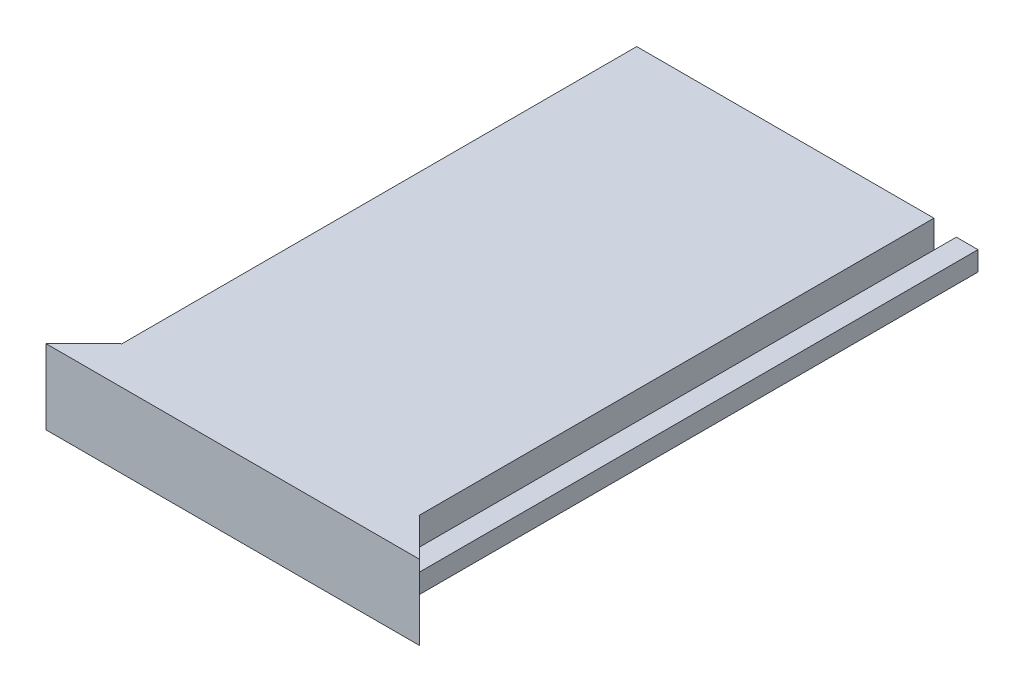
ISO-10303-21;
HEADER;
FILE_DESCRIPTION(('STEP AP214'),'2;1');
FILE_NAME('part.step','',(''),(''),'','','');
FILE_SCHEMA(('AUTOMOTIVE_DESIGN { 1 0 10303 214 1 1 1 1 }'));
ENDSEC;
DATA;
#1=APPLICATION_CONTEXT('core data for automotive mechanical design processes');
#2=APPLICATION_PROTOCOL_DEFINITION('international standard','automotive_design',2000,#1);
#3=PRODUCT_CONTEXT('',#1,'mechanical');
#4=PRODUCT('Part','Part','',(#3));
#5=PRODUCT_RELATED_PRODUCT_CATEGORY('part','',(#4));
#6=PRODUCT_DEFINITION_FORMATION('','',#4);
#7=PRODUCT_DEFINITION_CONTEXT('part definition',#1,'design');
#8=PRODUCT_DEFINITION('design','',#6,#7);
#9=PRODUCT_DEFINITION_SHAPE('','',#8);
#10=(LENGTH_UNIT() NAMED_UNIT(*) SI_UNIT(.MILLI.,.METRE.));
#11=(NAMED_UNIT(*) PLANE_ANGLE_UNIT() SI_UNIT($,.RADIAN.));
#12=(NAMED_UNIT(*) SI_UNIT($,.STERADIAN.) SOLID_ANGLE_UNIT());
#13=UNCERTAINTY_MEASURE_WITH_UNIT(LENGTH_MEASURE(1.E-05),#10,'distance_accuracy_value','');
#14=(GEOMETRIC_REPRESENTATION_CONTEXT(3) GLOBAL_UNCERTAINTY_ASSIGNED_CONTEXT((#13)) GLOBAL_UNIT_ASSIGNED_CONTEXT((#10,
#11,#12)) REPRESENTATION_CONTEXT('',''));
#15=CARTESIAN_POINT('',(0.,0.,0.));
#16=DIRECTION('',(0.,0.,1.));
#17=DIRECTION('',(1.,0.,0.));
#18=AXIS2_PLACEMENT_3D('',#15,#16,#17);
#19=CARTESIAN_POINT('',(0.,0.,-72.));
#20=DIRECTION('',(0.,0.,1.));
#21=DIRECTION('',(1.,0.,0.));
#22=AXIS2_PLACEMENT_3D('',#19,#20,#21);
#23=PLANE('',#22);
#24=DIRECTION('',(-1.,0.,0.));
#25=VECTOR('',#24,1.);
#26=CARTESIAN_POINT('',(-22.8,1.3,-72.));
#27=LINE('',#26,#25);
#28=CARTESIAN_POINT('',(-19.9,1.3,-72.));
#29=VERTEX_POINT('',#28);
#30=CARTESIAN_POINT('',(-22.8,1.3,-72.));
#31=VERTEX_POINT('',#30);
#32=EDGE_CURVE('E229',#29,#31,#27,.T.);
#33=ORIENTED_EDGE('',*,*,#32,.F.);
#34=DIRECTION('',(0.,1.,0.));
#35=VECTOR('',#34,1.);
#36=CARTESIAN_POINT('',(-19.9,-5.,-72.));
#37=LINE('',#36,#35);
#38=CARTESIAN_POINT('',(-19.9,-1.3,-72.));
#39=VERTEX_POINT('',#38);
#40=EDGE_CURVE('E357',#39,#29,#37,.T.);
#41=ORIENTED_EDGE('',*,*,#40,.F.);
#42=DIRECTION('',(1.,0.,0.));
#43=VECTOR('',#42,1.);
#44=CARTESIAN_POINT('',(-22.8,-1.3,-72.));
#45=LINE('',#44,#43);
#46=CARTESIAN_POINT('',(-22.8,-1.3,-72.));
#47=VERTEX_POINT('',#46);
#48=EDGE_CURVE('E223',#47,#39,#45,.T.);
#49=ORIENTED_EDGE('',*,*,#48,.F.);
#50=DIRECTION('',(0.,-1.,0.));
#51=VECTOR('',#50,1.);
#52=CARTESIAN_POINT('',(-22.8,1.3,-72.));
#53=LINE('',#52,#51);
#54=EDGE_CURVE('E219',#31,#47,#53,.T.);
#55=ORIENTED_EDGE('',*,*,#54,.F.);
#56=EDGE_LOOP('',(#33,#41,#49,#55));
#57=FACE_BOUND('',#56,.T.);
#58=ADVANCED_FACE('F35',(#57),#23,.F.);
#59=CARTESIAN_POINT('',(0.,0.,0.));
#60=DIRECTION('',(0.,0.,1.));
#61=DIRECTION('',(1.,0.,0.));
#62=AXIS2_PLACEMENT_3D('',#59,#60,#61);
#63=PLANE('',#62);
#64=DIRECTION('',(0.,-1.,0.));
#65=VECTOR('',#64,1.);
#66=CARTESIAN_POINT('',(19.9,-1.3,0.));
#67=LINE('',#66,#65);
#68=CARTESIAN_POINT('',(19.9,5.,0.));
#69=VERTEX_POINT('',#68);
#70=CARTESIAN_POINT('',(19.9,1.3,0.));
#71=VERTEX_POINT('',#70);
#72=EDGE_CURVE('E203',#69,#71,#67,.T.);
#73=ORIENTED_EDGE('',*,*,#72,.F.);
#74=DIRECTION('',(-1.,0.,0.));
#75=VECTOR('',#74,1.);
#76=CARTESIAN_POINT('',(-25.,5.,0.));
#77=LINE('',#76,#75);
#78=CARTESIAN_POINT('',(20.,5.,0.));
#79=VERTEX_POINT('',#78);
#80=EDGE_CURVE('E291',#79,#69,#77,.T.);
#81=ORIENTED_EDGE('',*,*,#80,.F.);
#82=DIRECTION('',(0.,1.,0.));
#83=VECTOR('',#82,1.);
#84=CARTESIAN_POINT('',(20.,-5.,0.));
#85=LINE('',#84,#83);
#86=CARTESIAN_POINT('',(20.,1.3,0.));
#87=VERTEX_POINT('',#86);
#88=EDGE_CURVE('E274',#87,#79,#85,.T.);
#89=ORIENTED_EDGE('',*,*,#88,.F.);
#90=DIRECTION('',(-1.,0.,0.));
#91=VECTOR('',#90,1.);
#92=CARTESIAN_POINT('',(0.,1.3,0.));
#93=LINE('',#92,#91);
#94=EDGE_CURVE('E251',#87,#71,#93,.T.);
#95=ORIENTED_EDGE('',*,*,#94,.T.);
#96=EDGE_LOOP('',(#73,#81,#89,#95));
#97=FACE_BOUND('',#96,.T.);
#98=ADVANCED_FACE('F326',(#97),#63,.F.);
#99=DIRECTION('',(0.,1.,0.));
#100=VECTOR('',#99,1.);
#101=CARTESIAN_POINT('',(-19.9,-1.3,0.));
#102=LINE('',#101,#100);
#103=CARTESIAN_POINT('',(-19.9,1.3,0.));
#104=VERTEX_POINT('',#103);
#105=CARTESIAN_POINT('',(-19.9,5.,0.));
#106=VERTEX_POINT('',#105);
#107=EDGE_CURVE('E197',#104,#106,#102,.T.);
#108=ORIENTED_EDGE('',*,*,#107,.F.);
#109=CARTESIAN_POINT('',(-20.,1.3,0.));
#110=VERTEX_POINT('',#109);
#111=EDGE_CURVE('E250',#104,#110,#93,.T.);
#112=ORIENTED_EDGE('',*,*,#111,.T.);
#113=DIRECTION('',(0.,1.,0.));
#114=VECTOR('',#113,1.);
#115=CARTESIAN_POINT('',(-20.,-5.,0.));
#116=LINE('',#115,#114);
#117=CARTESIAN_POINT('',(-20.,5.,0.));
#118=VERTEX_POINT('',#117);
#119=EDGE_CURVE('E265',#110,#118,#116,.T.);
#120=ORIENTED_EDGE('',*,*,#119,.T.);
#121=EDGE_CURVE('E269',#106,#118,#77,.T.);
#122=ORIENTED_EDGE('',*,*,#121,.F.);
#123=EDGE_LOOP('',(#108,#112,#120,#122));
#124=FACE_BOUND('',#123,.T.);
#125=ADVANCED_FACE('F401',(#124),#63,.F.);
#126=DIRECTION('',(1.,0.,0.));
#127=VECTOR('',#126,1.);
#128=CARTESIAN_POINT('',(0.,-1.3,0.));
#129=LINE('',#128,#127);
#130=CARTESIAN_POINT('',(-20.,-1.3,0.));
#131=VERTEX_POINT('',#130);
#132=CARTESIAN_POINT('',(-18.4,-1.3,0.));
#133=VERTEX_POINT('',#132);
#134=EDGE_CURVE('E57',#131,#133,#129,.T.);
#135=ORIENTED_EDGE('',*,*,#134,.T.);
#136=DIRECTION('',(0.,-1.,0.));
#137=VECTOR('',#136,1.);
#138=CARTESIAN_POINT('',(-18.4,-1.3,0.));
#139=LINE('',#138,#137);
#140=CARTESIAN_POINT('',(-18.4,3.,0.));
#141=VERTEX_POINT('',#140);
#142=EDGE_CURVE('E372',#141,#133,#139,.T.);
#143=ORIENTED_EDGE('',*,*,#142,.F.);
#144=DIRECTION('',(-1.,0.,0.));
#145=VECTOR('',#144,1.);
#146=CARTESIAN_POINT('',(18.4,3.,0.));
#147=LINE('',#146,#145);
#148=CARTESIAN_POINT('',(18.4,3.,0.));
#149=VERTEX_POINT('',#148);
#150=EDGE_CURVE('E370',#149,#141,#147,.T.);
#151=ORIENTED_EDGE('',*,*,#150,.F.);
#152=DIRECTION('',(0.,1.,0.));
#153=VECTOR('',#152,1.);
#154=CARTESIAN_POINT('',(18.4,-1.3,0.));
#155=LINE('',#154,#153);
#156=CARTESIAN_POINT('',(18.4,-1.3,0.));
#157=VERTEX_POINT('',#156);
#158=EDGE_CURVE('E344',#157,#149,#155,.T.);
#159=ORIENTED_EDGE('',*,*,#158,.F.);
#160=CARTESIAN_POINT('',(20.,-1.3,0.));
#161=VERTEX_POINT('',#160);
#162=EDGE_CURVE('E237',#157,#161,#129,.T.);
#163=ORIENTED_EDGE('',*,*,#162,.T.);
#164=CARTESIAN_POINT('',(20.,-5.,0.));
#165=VERTEX_POINT('',#164);
#166=EDGE_CURVE('E262',#165,#161,#85,.T.);
#167=ORIENTED_EDGE('',*,*,#166,.F.);
#168=DIRECTION('',(1.,0.,0.));
#169=VECTOR('',#168,1.);
#170=CARTESIAN_POINT('',(-25.,-5.,0.));
#171=LINE('',#170,#169);
#172=CARTESIAN_POINT('',(-20.,-5.,0.));
#173=VERTEX_POINT('',#172);
#174=EDGE_CURVE('E281',#173,#165,#171,.T.);
#175=ORIENTED_EDGE('',*,*,#174,.F.);
#176=EDGE_CURVE('E266',#173,#131,#116,.T.);
#177=ORIENTED_EDGE('',*,*,#176,.T.);
#178=EDGE_LOOP('',(#135,#143,#151,#159,#163,#167,#175,#177));
#179=FACE_BOUND('',#178,.T.);
#180=ADVANCED_FACE('F340',(#179),#63,.F.);
#181=CARTESIAN_POINT('',(-22.8,1.3,-72.));
#182=DIRECTION('',(0.,1.,0.));
#183=DIRECTION('',(0.,0.,1.));
#184=AXIS2_PLACEMENT_3D('',#181,#182,#183);
#185=PLANE('',#184);
#186=DIRECTION('',(0.,0.,1.));
#187=VECTOR('',#186,1.);
#188=CARTESIAN_POINT('',(-19.9,1.3,0.));
#189=LINE('',#188,#187);
#190=CARTESIAN_POINT('',(-19.9,1.3,-69.));
#191=VERTEX_POINT('',#190);
#192=EDGE_CURVE('E213',#29,#191,#189,.T.);
#193=ORIENTED_EDGE('',*,*,#192,.F.);
#194=ORIENTED_EDGE('',*,*,#32,.T.);
#195=DIRECTION('',(0.,0.,1.));
#196=VECTOR('',#195,1.);
#197=CARTESIAN_POINT('',(-22.8,1.3,-72.));
#198=LINE('',#197,#196);
#199=CARTESIAN_POINT('',(-22.8,1.3,2.80000000000001));
#200=VERTEX_POINT('',#199);
#201=EDGE_CURVE('E234',#31,#200,#198,.T.);
#202=ORIENTED_EDGE('',*,*,#201,.T.);
#203=DIRECTION('',(-0.707106781186551,0.,0.707106781186544));
#204=VECTOR('',#203,1.);
#205=CARTESIAN_POINT('',(-25.,1.3,5.));
#206=LINE('',#205,#204);
#207=EDGE_CURVE('E298',#110,#200,#206,.T.);
#208=ORIENTED_EDGE('',*,*,#207,.F.);
#209=ORIENTED_EDGE('',*,*,#111,.F.);
#210=EDGE_CURVE('E212',#191,#104,#189,.T.);
#211=ORIENTED_EDGE('',*,*,#210,.F.);
#212=EDGE_LOOP('',(#193,#194,#202,#208,#209,#211));
#213=FACE_BOUND('',#212,.T.);
#214=ADVANCED_FACE('F418',(#213),#185,.T.);
#215=CARTESIAN_POINT('',(-22.8,-1.3,-72.));
#216=DIRECTION('',(0.,-1.,0.));
#217=DIRECTION('',(0.,0.,-1.));
#218=AXIS2_PLACEMENT_3D('',#215,#216,#217);
#219=PLANE('',#218);
#220=DIRECTION('',(0.,0.,-1.));
#221=VECTOR('',#220,1.);
#222=CARTESIAN_POINT('',(-19.9,-1.3,-72.));
#223=LINE('',#222,#221);
#224=CARTESIAN_POINT('',(-19.9,-1.3,-69.));
#225=VERTEX_POINT('',#224);
#226=EDGE_CURVE('E367',#225,#39,#223,.T.);
#227=ORIENTED_EDGE('',*,*,#226,.F.);
#228=DIRECTION('',(-1.,0.,0.));
#229=VECTOR('',#228,1.);
#230=CARTESIAN_POINT('',(-22.8,-1.3,-69.));
#231=LINE('',#230,#229);
#232=CARTESIAN_POINT('',(-18.4,-1.3,-69.));
#233=VERTEX_POINT('',#232);
#234=EDGE_CURVE('E364',#233,#225,#231,.T.);
#235=ORIENTED_EDGE('',*,*,#234,.F.);
#236=DIRECTION('',(0.,0.,1.));
#237=VECTOR('',#236,1.);
#238=CARTESIAN_POINT('',(-18.4,-1.3,-112.295533251218));
#239=LINE('',#238,#237);
#240=EDGE_CURVE('E199',#233,#133,#239,.T.);
#241=ORIENTED_EDGE('',*,*,#240,.T.);
#242=ORIENTED_EDGE('',*,*,#134,.F.);
#243=DIRECTION('',(0.707106781186551,0.,-0.707106781186544));
#244=VECTOR('',#243,1.);
#245=CARTESIAN_POINT('',(-25.,-1.3,5.));
#246=LINE('',#245,#244);
#247=CARTESIAN_POINT('',(-22.8,-1.3,2.80000000000001));
#248=VERTEX_POINT('',#247);
#249=EDGE_CURVE('E290',#248,#131,#246,.T.);
#250=ORIENTED_EDGE('',*,*,#249,.F.);
#251=DIRECTION('',(0.,0.,1.));
#252=VECTOR('',#251,1.);
#253=CARTESIAN_POINT('',(-22.8,-1.3,-72.));
#254=LINE('',#253,#252);
#255=EDGE_CURVE('E233',#47,#248,#254,.T.);
#256=ORIENTED_EDGE('',*,*,#255,.F.);
#257=ORIENTED_EDGE('',*,*,#48,.T.);
#258=EDGE_LOOP('',(#227,#235,#241,#242,#250,#256,#257));
#259=FACE_BOUND('',#258,.T.);
#260=ADVANCED_FACE('F413',(#259),#219,.T.);
#261=CARTESIAN_POINT('',(-25.,5.,5.));
#262=DIRECTION('',(0.,-1.,0.));
#263=DIRECTION('',(0.,0.,-1.));
#264=AXIS2_PLACEMENT_3D('',#261,#262,#263);
#265=PLANE('',#264);
#266=DIRECTION('',(0.,0.,1.));
#267=VECTOR('',#266,1.);
#268=CARTESIAN_POINT('',(19.9,5.,-112.295533251218));
#269=LINE('',#268,#267);
#270=CARTESIAN_POINT('',(19.9,5.,-69.));
#271=VERTEX_POINT('',#270);
#272=EDGE_CURVE('E193',#271,#69,#269,.T.);
#273=ORIENTED_EDGE('',*,*,#272,.F.);
#274=DIRECTION('',(1.,0.,0.));
#275=VECTOR('',#274,1.);
#276=CARTESIAN_POINT('',(-19.9,5.,-69.));
#277=LINE('',#276,#275);
#278=CARTESIAN_POINT('',(-19.9,5.,-69.));
#279=VERTEX_POINT('',#278);
#280=EDGE_CURVE('E180',#279,#271,#277,.T.);
#281=ORIENTED_EDGE('',*,*,#280,.F.);
#282=DIRECTION('',(0.,0.,1.));
#283=VECTOR('',#282,1.);
#284=CARTESIAN_POINT('',(-19.9,5.,-112.295533251218));
#285=LINE('',#284,#283);
#286=EDGE_CURVE('E190',#279,#106,#285,.T.);
#287=ORIENTED_EDGE('',*,*,#286,.T.);
#288=ORIENTED_EDGE('',*,*,#121,.T.);
#289=DIRECTION('',(0.707106781186551,0.,-0.707106781186544));
#290=VECTOR('',#289,1.);
#291=CARTESIAN_POINT('',(-25.,5.,5.));
#292=LINE('',#291,#290);
#293=CARTESIAN_POINT('',(-25.,5.,5.));
#294=VERTEX_POINT('',#293);
#295=EDGE_CURVE('E258',#294,#118,#292,.T.);
#296=ORIENTED_EDGE('',*,*,#295,.F.);
#297=DIRECTION('',(-1.,0.,0.));
#298=VECTOR('',#297,1.);
#299=CARTESIAN_POINT('',(-25.,5.,5.));
#300=LINE('',#299,#298);
#301=CARTESIAN_POINT('',(25.,5.,5.));
#302=VERTEX_POINT('',#301);
#303=EDGE_CURVE('E280',#302,#294,#300,.T.);
#304=ORIENTED_EDGE('',*,*,#303,.F.);
#305=DIRECTION('',(0.707106781186546,0.,0.707106781186549));
#306=VECTOR('',#305,1.);
#307=CARTESIAN_POINT('',(25.,5.,5.));
#308=LINE('',#307,#306);
#309=EDGE_CURVE('E257',#79,#302,#308,.T.);
#310=ORIENTED_EDGE('',*,*,#309,.F.);
#311=ORIENTED_EDGE('',*,*,#80,.T.);
#312=EDGE_LOOP('',(#273,#281,#287,#288,#296,#304,#310,#311));
#313=FACE_BOUND('',#312,.T.);
#314=ADVANCED_FACE('F37',(#313),#265,.F.);
#315=CARTESIAN_POINT('',(-25.,-5.,5.));
#316=DIRECTION('',(0.,1.,0.));
#317=DIRECTION('',(0.,0.,1.));
#318=AXIS2_PLACEMENT_3D('',#315,#316,#317);
#319=PLANE('',#318);
#320=DIRECTION('',(1.,0.,0.));
#321=VECTOR('',#320,1.);
#322=CARTESIAN_POINT('',(-25.,-5.,5.));
#323=LINE('',#322,#321);
#324=CARTESIAN_POINT('',(-25.,-5.,5.));
#325=VERTEX_POINT('',#324);
#326=CARTESIAN_POINT('',(25.,-5.,5.));
#327=VERTEX_POINT('',#326);
#328=EDGE_CURVE('E287',#325,#327,#323,.T.);
#329=ORIENTED_EDGE('',*,*,#328,.F.);
#330=DIRECTION('',(0.707106781186551,0.,-0.707106781186544));
#331=VECTOR('',#330,1.);
#332=CARTESIAN_POINT('',(-25.,-5.,5.));
#333=LINE('',#332,#331);
#334=EDGE_CURVE('E261',#325,#173,#333,.T.);
#335=ORIENTED_EDGE('',*,*,#334,.T.);
#336=ORIENTED_EDGE('',*,*,#174,.T.);
#337=DIRECTION('',(0.707106781186546,0.,0.707106781186549));
#338=VECTOR('',#337,1.);
#339=CARTESIAN_POINT('',(25.,-5.,5.));
#340=LINE('',#339,#338);
#341=EDGE_CURVE('E271',#165,#327,#340,.T.);
#342=ORIENTED_EDGE('',*,*,#341,.T.);
#343=EDGE_LOOP('',(#329,#335,#336,#342));
#344=FACE_BOUND('',#343,.T.);
#345=ADVANCED_FACE('F337',(#344),#319,.F.);
#346=CARTESIAN_POINT('',(0.,0.,5.));
#347=DIRECTION('',(0.,0.,1.));
#348=DIRECTION('',(1.,0.,0.));
#349=AXIS2_PLACEMENT_3D('',#346,#347,#348);
#350=PLANE('',#349);
#351=DIRECTION('',(0.,1.,0.));
#352=VECTOR('',#351,1.);
#353=CARTESIAN_POINT('',(25.,5.,5.));
#354=LINE('',#353,#352);
#355=EDGE_CURVE('E277',#327,#302,#354,.T.);
#356=ORIENTED_EDGE('',*,*,#355,.T.);
#357=ORIENTED_EDGE('',*,*,#303,.T.);
#358=DIRECTION('',(0.,-1.,0.));
#359=VECTOR('',#358,1.);
#360=CARTESIAN_POINT('',(-25.,5.,5.));
#361=LINE('',#360,#359);
#362=EDGE_CURVE('E284',#294,#325,#361,.T.);
#363=ORIENTED_EDGE('',*,*,#362,.T.);
#364=ORIENTED_EDGE('',*,*,#328,.T.);
#365=EDGE_LOOP('',(#356,#357,#363,#364));
#366=FACE_BOUND('',#365,.T.);
#367=ADVANCED_FACE('F332',(#366),#350,.T.);
#368=CARTESIAN_POINT('',(25.,-5.,5.));
#369=DIRECTION('',(-0.707106781186549,0.,0.707106781186546));
#370=DIRECTION('',(0.707106781186546,0.,0.707106781186549));
#371=AXIS2_PLACEMENT_3D('',#368,#369,#370);
#372=PLANE('',#371);
#373=DIRECTION('',(0.,1.,0.));
#374=VECTOR('',#373,1.);
#375=CARTESIAN_POINT('',(22.8,-5.00000000000001,2.8));
#376=LINE('',#375,#374);
#377=CARTESIAN_POINT('',(22.8,-1.3,2.8));
#378=VERTEX_POINT('',#377);
#379=CARTESIAN_POINT('',(22.8,1.3,2.8));
#380=VERTEX_POINT('',#379);
#381=EDGE_CURVE('E43',#378,#380,#376,.T.);
#382=ORIENTED_EDGE('',*,*,#381,.T.);
#383=DIRECTION('',(-0.707106781186546,0.,-0.707106781186549));
#384=VECTOR('',#383,1.);
#385=CARTESIAN_POINT('',(25.,1.3,5.));
#386=LINE('',#385,#384);
#387=EDGE_CURVE('E254',#380,#87,#386,.T.);
#388=ORIENTED_EDGE('',*,*,#387,.T.);
#389=ORIENTED_EDGE('',*,*,#88,.T.);
#390=ORIENTED_EDGE('',*,*,#309,.T.);
#391=ORIENTED_EDGE('',*,*,#355,.F.);
#392=ORIENTED_EDGE('',*,*,#341,.F.);
#393=ORIENTED_EDGE('',*,*,#166,.T.);
#394=DIRECTION('',(0.707106781186546,0.,0.707106781186549));
#395=VECTOR('',#394,1.);
#396=CARTESIAN_POINT('',(25.,-1.3,5.));
#397=LINE('',#396,#395);
#398=EDGE_CURVE('E247',#161,#378,#397,.T.);
#399=ORIENTED_EDGE('',*,*,#398,.T.);
#400=EDGE_LOOP('',(#382,#388,#389,#390,#391,#392,#393,#399));
#401=FACE_BOUND('',#400,.T.);
#402=ADVANCED_FACE('F302',(#401),#372,.F.);
#403=CARTESIAN_POINT('',(-25.,-5.,5.));
#404=DIRECTION('',(0.707106781186544,0.,0.707106781186551));
#405=DIRECTION('',(0.707106781186551,0.,-0.707106781186544));
#406=AXIS2_PLACEMENT_3D('',#403,#404,#405);
#407=PLANE('',#406);
#408=ORIENTED_EDGE('',*,*,#119,.F.);
#409=ORIENTED_EDGE('',*,*,#207,.T.);
#410=DIRECTION('',(0.,-1.,0.));
#411=VECTOR('',#410,1.);
#412=CARTESIAN_POINT('',(-22.8,-5.,2.80000000000002));
#413=LINE('',#412,#411);
#414=EDGE_CURVE('E295',#200,#248,#413,.T.);
#415=ORIENTED_EDGE('',*,*,#414,.T.);
#416=ORIENTED_EDGE('',*,*,#249,.T.);
#417=ORIENTED_EDGE('',*,*,#176,.F.);
#418=ORIENTED_EDGE('',*,*,#334,.F.);
#419=ORIENTED_EDGE('',*,*,#362,.F.);
#420=ORIENTED_EDGE('',*,*,#295,.T.);
#421=EDGE_LOOP('',(#408,#409,#415,#416,#417,#418,#419,#420));
#422=FACE_BOUND('',#421,.T.);
#423=ADVANCED_FACE('F438',(#422),#407,.F.);
#424=CARTESIAN_POINT('',(22.8,1.3,-72.));
#425=DIRECTION('',(1.,0.,0.));
#426=DIRECTION('',(0.,1.,0.));
#427=AXIS2_PLACEMENT_3D('',#424,#425,#426);
#428=PLANE('',#427);
#429=ORIENTED_EDGE('',*,*,#381,.F.);
#430=DIRECTION('',(0.,0.,1.));
#431=VECTOR('',#430,1.);
#432=CARTESIAN_POINT('',(22.8,-1.3,-72.));
#433=LINE('',#432,#431);
#434=CARTESIAN_POINT('',(22.8,-1.3,-72.));
#435=VERTEX_POINT('',#434);
#436=EDGE_CURVE('E241',#435,#378,#433,.T.);
#437=ORIENTED_EDGE('',*,*,#436,.F.);
#438=DIRECTION('',(0.,1.,0.));
#439=VECTOR('',#438,1.);
#440=CARTESIAN_POINT('',(22.8,1.3,-72.));
#441=LINE('',#440,#439);
#442=CARTESIAN_POINT('',(22.8,1.3,-72.));
#443=VERTEX_POINT('',#442);
#444=EDGE_CURVE('E226',#435,#443,#441,.T.);
#445=ORIENTED_EDGE('',*,*,#444,.T.);
#446=DIRECTION('',(0.,0.,1.));
#447=VECTOR('',#446,1.);
#448=CARTESIAN_POINT('',(22.8,1.3,-72.));
#449=LINE('',#448,#447);
#450=EDGE_CURVE('E238',#443,#380,#449,.T.);
#451=ORIENTED_EDGE('',*,*,#450,.T.);
#452=EDGE_LOOP('',(#429,#437,#445,#451));
#453=FACE_BOUND('',#452,.T.);
#454=ADVANCED_FACE('F307',(#453),#428,.T.);
#455=CARTESIAN_POINT('',(-22.8,1.3,-72.));
#456=DIRECTION('',(-1.,0.,0.));
#457=DIRECTION('',(0.,0.,1.));
#458=AXIS2_PLACEMENT_3D('',#455,#456,#457);
#459=PLANE('',#458);
#460=ORIENTED_EDGE('',*,*,#414,.F.);
#461=ORIENTED_EDGE('',*,*,#201,.F.);
#462=ORIENTED_EDGE('',*,*,#54,.T.);
#463=ORIENTED_EDGE('',*,*,#255,.T.);
#464=EDGE_LOOP('',(#460,#461,#462,#463));
#465=FACE_BOUND('',#464,.T.);
#466=ADVANCED_FACE('F417',(#465),#459,.T.);
#467=DIRECTION('',(0.,0.,-1.));
#468=VECTOR('',#467,1.);
#469=CARTESIAN_POINT('',(19.9,1.3,0.));
#470=LINE('',#469,#468);
#471=CARTESIAN_POINT('',(19.9,1.3,-69.));
#472=VERTEX_POINT('',#471);
#473=EDGE_CURVE('E216',#71,#472,#470,.T.);
#474=ORIENTED_EDGE('',*,*,#473,.F.);
#475=ORIENTED_EDGE('',*,*,#94,.F.);
#476=ORIENTED_EDGE('',*,*,#387,.F.);
#477=ORIENTED_EDGE('',*,*,#450,.F.);
#478=CARTESIAN_POINT('',(19.9,1.3,-72.));
#479=VERTEX_POINT('',#478);
#480=EDGE_CURVE('E230',#443,#479,#27,.T.);
#481=ORIENTED_EDGE('',*,*,#480,.T.);
#482=EDGE_CURVE('E215',#472,#479,#470,.T.);
#483=ORIENTED_EDGE('',*,*,#482,.F.);
#484=EDGE_LOOP('',(#474,#475,#476,#477,#481,#483));
#485=FACE_BOUND('',#484,.T.);
#486=ADVANCED_FACE('F323',(#485),#185,.T.);
#487=DIRECTION('',(0.,0.,1.));
#488=VECTOR('',#487,1.);
#489=CARTESIAN_POINT('',(19.9,-1.3,-72.));
#490=LINE('',#489,#488);
#491=CARTESIAN_POINT('',(19.9,-1.3,-72.));
#492=VERTEX_POINT('',#491);
#493=CARTESIAN_POINT('',(19.9,-1.3,-69.));
#494=VERTEX_POINT('',#493);
#495=EDGE_CURVE('E314',#492,#494,#490,.T.);
#496=ORIENTED_EDGE('',*,*,#495,.F.);
#497=EDGE_CURVE('E222',#492,#435,#45,.T.);
#498=ORIENTED_EDGE('',*,*,#497,.T.);
#499=ORIENTED_EDGE('',*,*,#436,.T.);
#500=ORIENTED_EDGE('',*,*,#398,.F.);
#501=ORIENTED_EDGE('',*,*,#162,.F.);
#502=DIRECTION('',(0.,0.,1.));
#503=VECTOR('',#502,1.);
#504=CARTESIAN_POINT('',(18.4,-1.3,-112.295533251218));
#505=LINE('',#504,#503);
#506=CARTESIAN_POINT('',(18.4,-1.3,-69.));
#507=VERTEX_POINT('',#506);
#508=EDGE_CURVE('E210',#507,#157,#505,.T.);
#509=ORIENTED_EDGE('',*,*,#508,.F.);
#510=DIRECTION('',(-1.,0.,0.));
#511=VECTOR('',#510,1.);
#512=CARTESIAN_POINT('',(-22.8,-1.3,-69.));
#513=LINE('',#512,#511);
#514=EDGE_CURVE('E50',#494,#507,#513,.T.);
#515=ORIENTED_EDGE('',*,*,#514,.F.);
#516=EDGE_LOOP('',(#496,#498,#499,#500,#501,#509,#515));
#517=FACE_BOUND('',#516,.T.);
#518=ADVANCED_FACE('F311',(#517),#219,.T.);
#519=ORIENTED_EDGE('',*,*,#497,.F.);
#520=DIRECTION('',(0.,1.,0.));
#521=VECTOR('',#520,1.);
#522=CARTESIAN_POINT('',(19.9,-5.,-72.));
#523=LINE('',#522,#521);
#524=EDGE_CURVE('E319',#492,#479,#523,.T.);
#525=ORIENTED_EDGE('',*,*,#524,.T.);
#526=ORIENTED_EDGE('',*,*,#480,.F.);
#527=ORIENTED_EDGE('',*,*,#444,.F.);
#528=EDGE_LOOP('',(#519,#525,#526,#527));
#529=FACE_BOUND('',#528,.T.);
#530=ADVANCED_FACE('F317',(#529),#23,.F.);
#531=CARTESIAN_POINT('',(19.9,-1.3,-112.295533251218));
#532=DIRECTION('',(-1.,0.,0.));
#533=DIRECTION('',(0.,0.,1.));
#534=AXIS2_PLACEMENT_3D('',#531,#532,#533);
#535=PLANE('',#534);
#536=ORIENTED_EDGE('',*,*,#473,.T.);
#537=DIRECTION('',(0.,1.,0.));
#538=VECTOR('',#537,1.);
#539=CARTESIAN_POINT('',(19.9,-5.,-69.));
#540=LINE('',#539,#538);
#541=EDGE_CURVE('E377',#472,#271,#540,.T.);
#542=ORIENTED_EDGE('',*,*,#541,.T.);
#543=ORIENTED_EDGE('',*,*,#272,.T.);
#544=ORIENTED_EDGE('',*,*,#72,.T.);
#545=EDGE_LOOP('',(#536,#542,#543,#544));
#546=FACE_BOUND('',#545,.T.);
#547=ADVANCED_FACE('F376',(#546),#535,.F.);
#548=CARTESIAN_POINT('',(-19.9,-1.3,-112.295533251218));
#549=DIRECTION('',(1.,0.,0.));
#550=DIRECTION('',(0.,0.,-1.));
#551=AXIS2_PLACEMENT_3D('',#548,#549,#550);
#552=PLANE('',#551);
#553=ORIENTED_EDGE('',*,*,#286,.F.);
#554=DIRECTION('',(0.,1.,0.));
#555=VECTOR('',#554,1.);
#556=CARTESIAN_POINT('',(-19.9,-5.,-69.));
#557=LINE('',#556,#555);
#558=EDGE_CURVE('E177',#191,#279,#557,.T.);
#559=ORIENTED_EDGE('',*,*,#558,.F.);
#560=ORIENTED_EDGE('',*,*,#210,.T.);
#561=ORIENTED_EDGE('',*,*,#107,.T.);
#562=EDGE_LOOP('',(#553,#559,#560,#561));
#563=FACE_BOUND('',#562,.T.);
#564=ADVANCED_FACE('F195',(#563),#552,.F.);
#565=CARTESIAN_POINT('',(-18.4,-1.3,-112.295533251218));
#566=DIRECTION('',(-1.,0.,0.));
#567=DIRECTION('',(0.,0.,1.));
#568=AXIS2_PLACEMENT_3D('',#565,#566,#567);
#569=PLANE('',#568);
#570=ORIENTED_EDGE('',*,*,#240,.F.);
#571=DIRECTION('',(0.,1.,0.));
#572=VECTOR('',#571,1.);
#573=CARTESIAN_POINT('',(-18.4,-1.3,-69.));
#574=LINE('',#573,#572);
#575=CARTESIAN_POINT('',(-18.4,3.,-69.));
#576=VERTEX_POINT('',#575);
#577=EDGE_CURVE('E356',#233,#576,#574,.T.);
#578=ORIENTED_EDGE('',*,*,#577,.T.);
#579=DIRECTION('',(0.,0.,1.));
#580=VECTOR('',#579,1.);
#581=CARTESIAN_POINT('',(-18.4,3.,-112.295533251218));
#582=LINE('',#581,#580);
#583=EDGE_CURVE('E201',#576,#141,#582,.T.);
#584=ORIENTED_EDGE('',*,*,#583,.T.);
#585=ORIENTED_EDGE('',*,*,#142,.T.);
#586=EDGE_LOOP('',(#570,#578,#584,#585));
#587=FACE_BOUND('',#586,.T.);
#588=ADVANCED_FACE('F526',(#587),#569,.F.);
#589=CARTESIAN_POINT('',(18.4,3.,-112.295533251218));
#590=DIRECTION('',(0.,1.,0.));
#591=DIRECTION('',(0.,0.,1.));
#592=AXIS2_PLACEMENT_3D('',#589,#590,#591);
#593=PLANE('',#592);
#594=ORIENTED_EDGE('',*,*,#583,.F.);
#595=DIRECTION('',(1.,0.,0.));
#596=VECTOR('',#595,1.);
#597=CARTESIAN_POINT('',(18.4,3.,-69.));
#598=LINE('',#597,#596);
#599=CARTESIAN_POINT('',(18.4,3.,-69.));
#600=VERTEX_POINT('',#599);
#601=EDGE_CURVE('E350',#576,#600,#598,.T.);
#602=ORIENTED_EDGE('',*,*,#601,.T.);
#603=DIRECTION('',(0.,0.,1.));
#604=VECTOR('',#603,1.);
#605=CARTESIAN_POINT('',(18.4,3.,-112.295533251218));
#606=LINE('',#605,#604);
#607=EDGE_CURVE('E208',#600,#149,#606,.T.);
#608=ORIENTED_EDGE('',*,*,#607,.T.);
#609=ORIENTED_EDGE('',*,*,#150,.T.);
#610=EDGE_LOOP('',(#594,#602,#608,#609));
#611=FACE_BOUND('',#610,.T.);
#612=ADVANCED_FACE('F354',(#611),#593,.F.);
#613=CARTESIAN_POINT('',(18.4,-1.3,-112.295533251218));
#614=DIRECTION('',(1.,0.,0.));
#615=DIRECTION('',(0.,0.,-1.));
#616=AXIS2_PLACEMENT_3D('',#613,#614,#615);
#617=PLANE('',#616);
#618=ORIENTED_EDGE('',*,*,#607,.F.);
#619=DIRECTION('',(0.,-1.,0.));
#620=VECTOR('',#619,1.);
#621=CARTESIAN_POINT('',(18.4,-1.3,-69.));
#622=LINE('',#621,#620);
#623=EDGE_CURVE('E11',#600,#507,#622,.T.);
#624=ORIENTED_EDGE('',*,*,#623,.T.);
#625=ORIENTED_EDGE('',*,*,#508,.T.);
#626=ORIENTED_EDGE('',*,*,#158,.T.);
#627=EDGE_LOOP('',(#618,#624,#625,#626));
#628=FACE_BOUND('',#627,.T.);
#629=ADVANCED_FACE('F348',(#628),#617,.F.);
#630=CARTESIAN_POINT('',(-19.9,-5.,-72.));
#631=DIRECTION('',(-1.,0.,0.));
#632=DIRECTION('',(0.,0.,1.));
#633=AXIS2_PLACEMENT_3D('',#630,#631,#632);
#634=PLANE('',#633);
#635=ORIENTED_EDGE('',*,*,#192,.T.);
#636=EDGE_CURVE('E183',#225,#191,#557,.T.);
#637=ORIENTED_EDGE('',*,*,#636,.F.);
#638=ORIENTED_EDGE('',*,*,#226,.T.);
#639=ORIENTED_EDGE('',*,*,#40,.T.);
#640=EDGE_LOOP('',(#635,#637,#638,#639));
#641=FACE_BOUND('',#640,.T.);
#642=ADVANCED_FACE('F384',(#641),#634,.F.);
#643=CARTESIAN_POINT('',(19.9,-5.,-72.));
#644=DIRECTION('',(1.,0.,0.));
#645=DIRECTION('',(0.,0.,-1.));
#646=AXIS2_PLACEMENT_3D('',#643,#644,#645);
#647=PLANE('',#646);
#648=ORIENTED_EDGE('',*,*,#482,.T.);
#649=ORIENTED_EDGE('',*,*,#524,.F.);
#650=ORIENTED_EDGE('',*,*,#495,.T.);
#651=EDGE_CURVE('E379',#494,#472,#540,.T.);
#652=ORIENTED_EDGE('',*,*,#651,.T.);
#653=EDGE_LOOP('',(#648,#649,#650,#652));
#654=FACE_BOUND('',#653,.T.);
#655=ADVANCED_FACE('F382',(#654),#647,.F.);
#656=CARTESIAN_POINT('',(-19.9,-5.,-69.));
#657=DIRECTION('',(0.,0.,1.));
#658=DIRECTION('',(1.,0.,0.));
#659=AXIS2_PLACEMENT_3D('',#656,#657,#658);
#660=PLANE('',#659);
#661=ORIENTED_EDGE('',*,*,#234,.T.);
#662=ORIENTED_EDGE('',*,*,#636,.T.);
#663=ORIENTED_EDGE('',*,*,#558,.T.);
#664=ORIENTED_EDGE('',*,*,#280,.T.);
#665=ORIENTED_EDGE('',*,*,#541,.F.);
#666=ORIENTED_EDGE('',*,*,#651,.F.);
#667=ORIENTED_EDGE('',*,*,#514,.T.);
#668=ORIENTED_EDGE('',*,*,#623,.F.);
#669=ORIENTED_EDGE('',*,*,#601,.F.);
#670=ORIENTED_EDGE('',*,*,#577,.F.);
#671=EDGE_LOOP('',(#661,#662,#663,#664,#665,#666,#667,#668,#669,#670));
#672=FACE_BOUND('',#671,.T.);
#673=ADVANCED_FACE('F179',(#672),#660,.F.);
#674=CLOSED_SHELL('',(#58,#98,#125,#180,#214,#260,#314,#345,#367,#402,#423,#454,#466,#486,#518,
#530,#547,#564,#588,#612,#629,#642,#655,#673));
#675=MANIFOLD_SOLID_BREP('B2',#674);
#676=ADVANCED_BREP_SHAPE_REPRESENTATION('',(#18,#675),#14);
#677=SHAPE_DEFINITION_REPRESENTATION(#9,#676);
ENDSEC;
END-ISO-10303-21;
